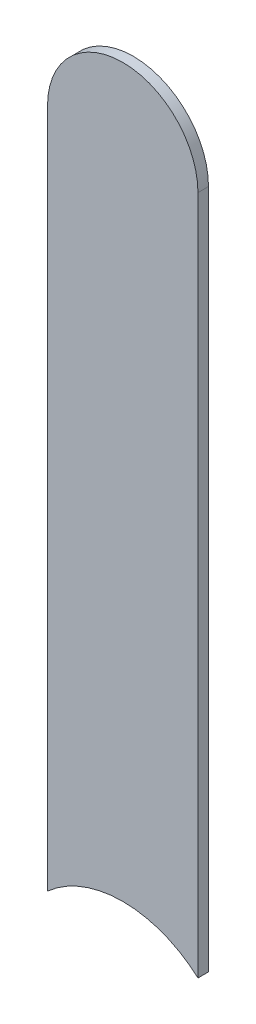
ISO-10303-21;
HEADER;
FILE_DESCRIPTION(('STEP AP214'),'2;1');
FILE_NAME('part.step','',(''),(''),'','','');
FILE_SCHEMA(('AUTOMOTIVE_DESIGN { 1 0 10303 214 1 1 1 1 }'));
ENDSEC;
DATA;
#1=APPLICATION_CONTEXT('core data for automotive mechanical design processes');
#2=APPLICATION_PROTOCOL_DEFINITION('international standard','automotive_design',2000,#1);
#3=PRODUCT_CONTEXT('',#1,'mechanical');
#4=PRODUCT('Part','Part','',(#3));
#5=PRODUCT_RELATED_PRODUCT_CATEGORY('part','',(#4));
#6=PRODUCT_DEFINITION_FORMATION('','',#4);
#7=PRODUCT_DEFINITION_CONTEXT('part definition',#1,'design');
#8=PRODUCT_DEFINITION('design','',#6,#7);
#9=PRODUCT_DEFINITION_SHAPE('','',#8);
#10=(LENGTH_UNIT() NAMED_UNIT(*) SI_UNIT(.MILLI.,.METRE.));
#11=(NAMED_UNIT(*) PLANE_ANGLE_UNIT() SI_UNIT($,.RADIAN.));
#12=(NAMED_UNIT(*) SI_UNIT($,.STERADIAN.) SOLID_ANGLE_UNIT());
#13=UNCERTAINTY_MEASURE_WITH_UNIT(LENGTH_MEASURE(1.E-05),#10,'distance_accuracy_value','');
#14=(GEOMETRIC_REPRESENTATION_CONTEXT(3) GLOBAL_UNCERTAINTY_ASSIGNED_CONTEXT((#13)) GLOBAL_UNIT_ASSIGNED_CONTEXT((#10,
#11,#12)) REPRESENTATION_CONTEXT('',''));
#15=CARTESIAN_POINT('',(0.,0.,0.));
#16=DIRECTION('',(0.,0.,1.));
#17=DIRECTION('',(1.,0.,0.));
#18=AXIS2_PLACEMENT_3D('',#15,#16,#17);
#19=CARTESIAN_POINT('',(127.25,-80.772,-0.035));
#20=DIRECTION('',(-1.,0.,0.));
#21=DIRECTION('',(0.,0.,1.));
#22=AXIS2_PLACEMENT_3D('',#19,#20,#21);
#23=PLANE('',#22);
#24=DIRECTION('',(0.,0.,1.));
#25=VECTOR('',#24,1.);
#26=CARTESIAN_POINT('',(127.25,-78.232,-0.035));
#27=LINE('',#26,#25);
#28=CARTESIAN_POINT('',(127.25,-78.232,-0.035));
#29=VERTEX_POINT('',#28);
#30=CARTESIAN_POINT('',(127.25,-78.232,0.));
#31=VERTEX_POINT('',#30);
#32=EDGE_CURVE('E11',#29,#31,#27,.T.);
#33=ORIENTED_EDGE('',*,*,#32,.T.);
#34=DIRECTION('',(0.,1.,0.));
#35=VECTOR('',#34,1.);
#36=CARTESIAN_POINT('',(127.25,-80.772,0.));
#37=LINE('',#36,#35);
#38=CARTESIAN_POINT('',(127.25,-80.49249150282,0.));
#39=VERTEX_POINT('',#38);
#40=EDGE_CURVE('E25',#39,#31,#37,.T.);
#41=ORIENTED_EDGE('',*,*,#40,.F.);
#42=DIRECTION('',(0.,0.,-1.));
#43=VECTOR('',#42,1.);
#44=CARTESIAN_POINT('',(127.25,-80.49249150281,-0.045));
#45=LINE('',#44,#43);
#46=CARTESIAN_POINT('',(127.25,-80.49249150282,-0.035));
#47=VERTEX_POINT('',#46);
#48=EDGE_CURVE('E73',#39,#47,#45,.T.);
#49=ORIENTED_EDGE('',*,*,#48,.T.);
#50=DIRECTION('',(0.,1.,0.));
#51=VECTOR('',#50,1.);
#52=CARTESIAN_POINT('',(127.25,-80.772,-0.035));
#53=LINE('',#52,#51);
#54=EDGE_CURVE('E103',#47,#29,#53,.T.);
#55=ORIENTED_EDGE('',*,*,#54,.T.);
#56=EDGE_LOOP('',(#33,#41,#49,#55));
#57=FACE_BOUND('',#56,.T.);
#58=ADVANCED_FACE('F17',(#57),#23,.F.);
#59=CARTESIAN_POINT('',(127.,-78.232,-0.035));
#60=DIRECTION('',(0.,0.,-1.));
#61=DIRECTION('',(1.,0.,0.));
#62=AXIS2_PLACEMENT_3D('',#59,#60,#61);
#63=CYLINDRICAL_SURFACE('',#62,0.25);
#64=CARTESIAN_POINT('',(127.,-78.232,-0.035));
#65=DIRECTION('',(0.,0.,1.));
#66=DIRECTION('',(1.,0.,0.));
#67=AXIS2_PLACEMENT_3D('',#64,#65,#66);
#68=CIRCLE('',#67,0.25);
#69=CARTESIAN_POINT('',(126.75,-78.232,-0.035));
#70=VERTEX_POINT('',#69);
#71=EDGE_CURVE('E76',#29,#70,#68,.T.);
#72=ORIENTED_EDGE('',*,*,#71,.T.);
#73=DIRECTION('',(0.,0.,1.));
#74=VECTOR('',#73,1.);
#75=CARTESIAN_POINT('',(126.75,-78.232,-0.035));
#76=LINE('',#75,#74);
#77=CARTESIAN_POINT('',(126.75,-78.232,0.));
#78=VERTEX_POINT('',#77);
#79=EDGE_CURVE('E87',#70,#78,#76,.T.);
#80=ORIENTED_EDGE('',*,*,#79,.T.);
#81=CARTESIAN_POINT('',(127.,-78.232,0.));
#82=DIRECTION('',(0.,0.,1.));
#83=DIRECTION('',(1.,0.,0.));
#84=AXIS2_PLACEMENT_3D('',#81,#82,#83);
#85=CIRCLE('',#84,0.25);
#86=EDGE_CURVE('E82',#31,#78,#85,.T.);
#87=ORIENTED_EDGE('',*,*,#86,.F.);
#88=ORIENTED_EDGE('',*,*,#32,.F.);
#89=EDGE_LOOP('',(#72,#80,#87,#88));
#90=FACE_BOUND('',#89,.T.);
#91=ADVANCED_FACE('F118',(#90),#63,.T.);
#92=CARTESIAN_POINT('',(126.75,-78.232,0.));
#93=DIRECTION('',(0.,0.,1.));
#94=DIRECTION('',(1.,0.,0.));
#95=AXIS2_PLACEMENT_3D('',#92,#93,#94);
#96=PLANE('',#95);
#97=ORIENTED_EDGE('',*,*,#86,.T.);
#98=DIRECTION('',(0.,-1.,0.));
#99=VECTOR('',#98,1.);
#100=CARTESIAN_POINT('',(126.75,-78.232,0.));
#101=LINE('',#100,#99);
#102=CARTESIAN_POINT('',(126.75,-80.49249150281,0.));
#103=VERTEX_POINT('',#102);
#104=EDGE_CURVE('E79',#78,#103,#101,.T.);
#105=ORIENTED_EDGE('',*,*,#104,.T.);
#106=CARTESIAN_POINT('',(127.,-80.772,0.));
#107=DIRECTION('',(0.,0.,-1.));
#108=DIRECTION('',(0.,-1.,0.));
#109=AXIS2_PLACEMENT_3D('',#106,#107,#108);
#110=CIRCLE('',#109,0.375);
#111=EDGE_CURVE('E67',#103,#39,#110,.T.);
#112=ORIENTED_EDGE('',*,*,#111,.T.);
#113=ORIENTED_EDGE('',*,*,#40,.T.);
#114=EDGE_LOOP('',(#97,#105,#112,#113));
#115=FACE_BOUND('',#114,.T.);
#116=ADVANCED_FACE('F80',(#115),#96,.T.);
#117=CARTESIAN_POINT('',(127.,-80.772,-0.045));
#118=DIRECTION('',(0.,0.,-1.));
#119=DIRECTION('',(0.,-1.,0.));
#120=AXIS2_PLACEMENT_3D('',#117,#118,#119);
#121=CYLINDRICAL_SURFACE('',#120,0.375);
#122=ORIENTED_EDGE('',*,*,#111,.F.);
#123=DIRECTION('',(0.,0.,-1.));
#124=VECTOR('',#123,1.);
#125=CARTESIAN_POINT('',(126.75,-80.49249150281,-0.045));
#126=LINE('',#125,#124);
#127=CARTESIAN_POINT('',(126.75,-80.49249150281,-0.035));
#128=VERTEX_POINT('',#127);
#129=EDGE_CURVE('E72',#103,#128,#126,.T.);
#130=ORIENTED_EDGE('',*,*,#129,.T.);
#131=CARTESIAN_POINT('',(127.,-80.772,-0.035));
#132=DIRECTION('',(0.,0.,-1.));
#133=DIRECTION('',(0.,-1.,0.));
#134=AXIS2_PLACEMENT_3D('',#131,#132,#133);
#135=CIRCLE('',#134,0.375);
#136=EDGE_CURVE('E105',#128,#47,#135,.T.);
#137=ORIENTED_EDGE('',*,*,#136,.T.);
#138=ORIENTED_EDGE('',*,*,#48,.F.);
#139=EDGE_LOOP('',(#122,#130,#137,#138));
#140=FACE_BOUND('',#139,.T.);
#141=ADVANCED_FACE('F69',(#140),#121,.F.);
#142=CARTESIAN_POINT('',(126.75,-78.232,-0.035));
#143=DIRECTION('',(0.,0.,1.));
#144=DIRECTION('',(1.,0.,0.));
#145=AXIS2_PLACEMENT_3D('',#142,#143,#144);
#146=PLANE('',#145);
#147=ORIENTED_EDGE('',*,*,#54,.F.);
#148=ORIENTED_EDGE('',*,*,#136,.F.);
#149=DIRECTION('',(0.,-1.,0.));
#150=VECTOR('',#149,1.);
#151=CARTESIAN_POINT('',(126.75,-78.232,-0.035));
#152=LINE('',#151,#150);
#153=EDGE_CURVE('E92',#70,#128,#152,.T.);
#154=ORIENTED_EDGE('',*,*,#153,.F.);
#155=ORIENTED_EDGE('',*,*,#71,.F.);
#156=EDGE_LOOP('',(#147,#148,#154,#155));
#157=FACE_BOUND('',#156,.T.);
#158=ADVANCED_FACE('F122',(#157),#146,.F.);
#159=CARTESIAN_POINT('',(126.75,-78.232,-0.035));
#160=DIRECTION('',(1.,0.,0.));
#161=DIRECTION('',(0.,1.,0.));
#162=AXIS2_PLACEMENT_3D('',#159,#160,#161);
#163=PLANE('',#162);
#164=ORIENTED_EDGE('',*,*,#129,.F.);
#165=ORIENTED_EDGE('',*,*,#104,.F.);
#166=ORIENTED_EDGE('',*,*,#79,.F.);
#167=ORIENTED_EDGE('',*,*,#153,.T.);
#168=EDGE_LOOP('',(#164,#165,#166,#167));
#169=FACE_BOUND('',#168,.T.);
#170=ADVANCED_FACE('F90',(#169),#163,.F.);
#171=CLOSED_SHELL('',(#58,#91,#116,#141,#158,#170));
#172=MANIFOLD_SOLID_BREP('B1',#171);
#173=ADVANCED_BREP_SHAPE_REPRESENTATION('',(#18,#172),#14);
#174=SHAPE_DEFINITION_REPRESENTATION(#9,#173);
ENDSEC;
END-ISO-10303-21;
